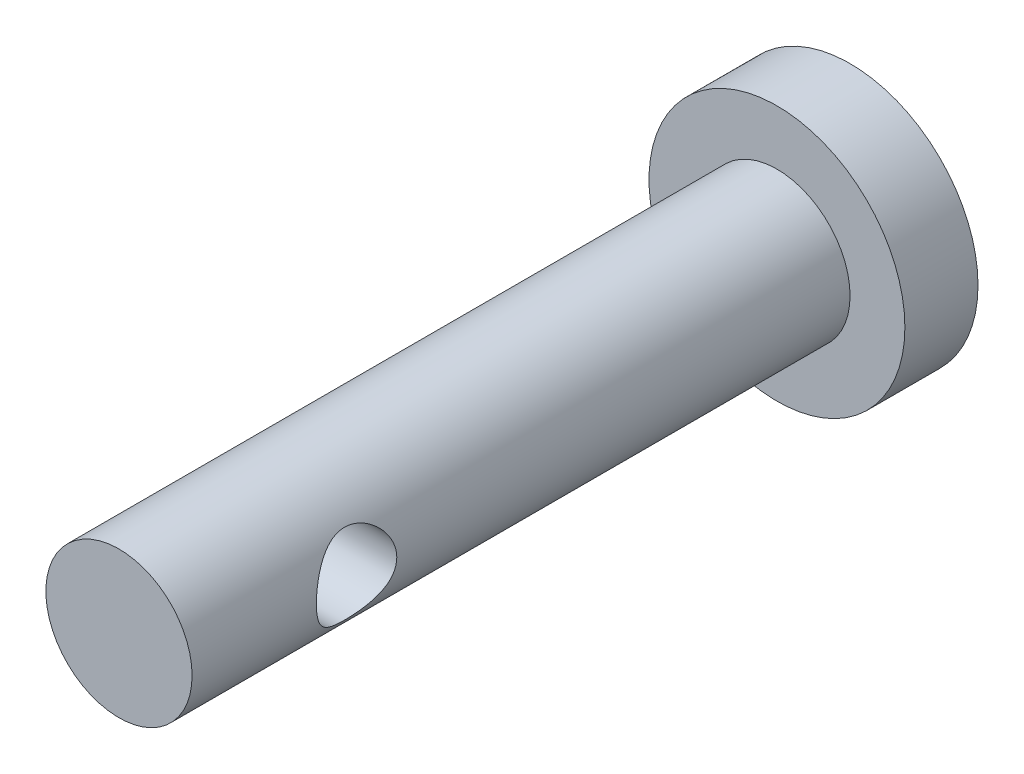
ISO-10303-21;
HEADER;
FILE_DESCRIPTION(('STEP AP214'),'2;1');
FILE_NAME('part.step','',(''),(''),'','','');
FILE_SCHEMA(('AUTOMOTIVE_DESIGN { 1 0 10303 214 1 1 1 1 }'));
ENDSEC;
DATA;
#1=APPLICATION_CONTEXT('core data for automotive mechanical design processes');
#2=APPLICATION_PROTOCOL_DEFINITION('international standard','automotive_design',2000,#1);
#3=PRODUCT_CONTEXT('',#1,'mechanical');
#4=PRODUCT('Part','Part','',(#3));
#5=PRODUCT_RELATED_PRODUCT_CATEGORY('part','',(#4));
#6=PRODUCT_DEFINITION_FORMATION('','',#4);
#7=PRODUCT_DEFINITION_CONTEXT('part definition',#1,'design');
#8=PRODUCT_DEFINITION('design','',#6,#7);
#9=PRODUCT_DEFINITION_SHAPE('','',#8);
#10=(LENGTH_UNIT() NAMED_UNIT(*) SI_UNIT(.MILLI.,.METRE.));
#11=(NAMED_UNIT(*) PLANE_ANGLE_UNIT() SI_UNIT($,.RADIAN.));
#12=(NAMED_UNIT(*) SI_UNIT($,.STERADIAN.) SOLID_ANGLE_UNIT());
#13=UNCERTAINTY_MEASURE_WITH_UNIT(LENGTH_MEASURE(1.E-05),#10,'distance_accuracy_value','');
#14=(GEOMETRIC_REPRESENTATION_CONTEXT(3) GLOBAL_UNCERTAINTY_ASSIGNED_CONTEXT((#13)) GLOBAL_UNIT_ASSIGNED_CONTEXT((#10,
#11,#12)) REPRESENTATION_CONTEXT('',''));
#15=CARTESIAN_POINT('',(0.,0.,0.));
#16=DIRECTION('',(0.,0.,1.));
#17=DIRECTION('',(1.,0.,0.));
#18=AXIS2_PLACEMENT_3D('',#15,#16,#17);
#19=CARTESIAN_POINT('',(0.,0.,2.));
#20=DIRECTION('',(0.,0.,-1.));
#21=DIRECTION('',(-1.,0.,0.));
#22=AXIS2_PLACEMENT_3D('',#19,#20,#21);
#23=CYLINDRICAL_SURFACE('',#22,3.5);
#24=CARTESIAN_POINT('',(0.,0.,2.));
#25=DIRECTION('',(0.,0.,1.));
#26=DIRECTION('',(1.,0.,0.));
#27=AXIS2_PLACEMENT_3D('',#24,#25,#26);
#28=CIRCLE('',#27,3.5);
#29=CARTESIAN_POINT('',(3.5,0.,2.));
#30=VERTEX_POINT('',#29);
#31=EDGE_CURVE('E52',#30,#30,#28,.T.);
#32=ORIENTED_EDGE('',*,*,#31,.F.);
#33=EDGE_LOOP('',(#32));
#34=FACE_BOUND('',#33,.T.);
#35=CARTESIAN_POINT('',(0.,0.,0.));
#36=DIRECTION('',(0.,0.,1.));
#37=DIRECTION('',(1.,0.,0.));
#38=AXIS2_PLACEMENT_3D('',#35,#36,#37);
#39=CIRCLE('',#38,3.5);
#40=CARTESIAN_POINT('',(3.5,0.,0.));
#41=VERTEX_POINT('',#40);
#42=EDGE_CURVE('E58',#41,#41,#39,.T.);
#43=ORIENTED_EDGE('',*,*,#42,.T.);
#44=EDGE_LOOP('',(#43));
#45=FACE_BOUND('',#44,.T.);
#46=ADVANCED_FACE('F36',(#34,#45),#23,.T.);
#47=CARTESIAN_POINT('',(0.,0.,2.));
#48=DIRECTION('',(0.,0.,1.));
#49=DIRECTION('',(1.,0.,0.));
#50=AXIS2_PLACEMENT_3D('',#47,#48,#49);
#51=PLANE('',#50);
#52=CARTESIAN_POINT('',(0.,0.,2.));
#53=DIRECTION('',(0.,0.,1.));
#54=DIRECTION('',(1.,0.,0.));
#55=AXIS2_PLACEMENT_3D('',#52,#53,#54);
#56=CIRCLE('',#55,2.);
#57=CARTESIAN_POINT('',(2.,0.,2.));
#58=VERTEX_POINT('',#57);
#59=EDGE_CURVE('E48',#58,#58,#56,.T.);
#60=ORIENTED_EDGE('',*,*,#59,.F.);
#61=EDGE_LOOP('',(#60));
#62=FACE_BOUND('',#61,.T.);
#63=ORIENTED_EDGE('',*,*,#31,.T.);
#64=EDGE_LOOP('',(#63));
#65=FACE_BOUND('',#64,.T.);
#66=ADVANCED_FACE('F80',(#62,#65),#51,.T.);
#67=CARTESIAN_POINT('',(0.,0.,0.));
#68=DIRECTION('',(0.,0.,1.));
#69=DIRECTION('',(1.,0.,0.));
#70=AXIS2_PLACEMENT_3D('',#67,#68,#69);
#71=PLANE('',#70);
#72=ORIENTED_EDGE('',*,*,#42,.F.);
#73=EDGE_LOOP('',(#72));
#74=FACE_BOUND('',#73,.T.);
#75=ADVANCED_FACE('F76',(#74),#71,.F.);
#76=CARTESIAN_POINT('',(0.,0.,20.));
#77=DIRECTION('',(0.,0.,-1.));
#78=DIRECTION('',(-1.,0.,0.));
#79=AXIS2_PLACEMENT_3D('',#76,#77,#78);
#80=CYLINDRICAL_SURFACE('',#79,2.);
#81=CARTESIAN_POINT('',(2.,0.,16.6));
#82=CARTESIAN_POINT('',(1.99999675924308,0.0571132983637053,16.5999964110813));
#83=CARTESIAN_POINT('',(1.99752868170342,0.114272714137144,16.5955262362727));
#84=CARTESIAN_POINT('',(1.98789855994148,0.226857367817319,16.5778651898464));
#85=CARTESIAN_POINT('',(1.98073010854729,0.282280130253228,16.5646624144346));
#86=CARTESIAN_POINT('',(1.96243812463521,0.389601051952438,16.5302303571189));
#87=CARTESIAN_POINT('',(1.95133089970991,0.44151270844495,16.5090341475802));
#88=CARTESIAN_POINT('',(1.92614108353208,0.540938827090506,16.4594142212174));
#89=CARTESIAN_POINT('',(1.91205836516769,0.588453101264448,16.4309901956133));
#90=CARTESIAN_POINT('',(1.88102168662336,0.681410795715168,16.3655231112503));
#91=CARTESIAN_POINT('',(1.86393685342201,0.726486915618605,16.3280216503706));
#92=CARTESIAN_POINT('',(1.82916903148557,0.810057561556778,16.2464722610266));
#93=CARTESIAN_POINT('',(1.81148550185214,0.848545934897066,16.2024182837536));
#94=CARTESIAN_POINT('',(1.77547930553327,0.921679451273309,16.1038493427182));
#95=CARTESIAN_POINT('',(1.757265310528,0.955572384755911,16.0487313590102));
#96=CARTESIAN_POINT('',(1.72452224317789,1.01347698490626,15.9325150895782));
#97=CARTESIAN_POINT('',(1.70999026263348,1.0374964594112,15.8714215767618));
#98=CARTESIAN_POINT('',(1.68775650057705,1.07326593950759,15.7488203677151));
#99=CARTESIAN_POINT('',(1.67968128236562,1.08569508898053,15.6875825643648));
#100=CARTESIAN_POINT('',(1.67039270422593,1.09994080420756,15.5634070342956));
#101=CARTESIAN_POINT('',(1.66916950596314,1.10177258610198,15.5004718753173));
#102=CARTESIAN_POINT('',(1.67343764484105,1.09526666719243,15.385047762167));
#103=CARTESIAN_POINT('',(1.67793532909928,1.08843438295616,15.3324268276671));
#104=CARTESIAN_POINT('',(1.69135685033582,1.06745759351263,15.2292470533978));
#105=CARTESIAN_POINT('',(1.70028270327645,1.05330975771273,15.1786891642039));
#106=CARTESIAN_POINT('',(1.72170753964095,1.0179176089501,15.0796784533327));
#107=CARTESIAN_POINT('',(1.73427940344615,0.996526887131073,15.0312945081385));
#108=CARTESIAN_POINT('',(1.76160601646088,0.947382866660586,14.9385526529354));
#109=CARTESIAN_POINT('',(1.77636170690481,0.91962682169107,14.8941964922787));
#110=CARTESIAN_POINT('',(1.8091936056527,0.853455662743701,14.8034034776133));
#111=CARTESIAN_POINT('',(1.82742638095051,0.814049722616954,14.7577426320771));
#112=CARTESIAN_POINT('',(1.86331585258471,0.728163547976673,14.6733156128991));
#113=CARTESIAN_POINT('',(1.88097214812395,0.681678513773091,14.6345541560717));
#114=CARTESIAN_POINT('',(1.91514756035155,0.579070027867289,14.5625234488777));
#115=CARTESIAN_POINT('',(1.93151098770795,0.522509240968693,14.5297969062474));
#116=CARTESIAN_POINT('',(1.95981018910102,0.403568251763486,14.4746128310417));
#117=CARTESIAN_POINT('',(1.97175012386492,0.341193587463994,14.4521456438889));
#118=CARTESIAN_POINT('',(1.98888897082801,0.218604691987317,14.4202585263745));
#119=CARTESIAN_POINT('',(1.99461215188408,0.158730320348858,14.4098182989883));
#120=CARTESIAN_POINT('',(2.00055584441335,0.0378216889616743,14.3989794475287));
#121=CARTESIAN_POINT('',(2.00077987218944,-0.0232118046229579,14.3985744066921));
#122=CARTESIAN_POINT('',(1.99596118554524,-0.13832491676724,14.4073563422037));
#123=CARTESIAN_POINT('',(1.99143106391449,-0.192501184158295,14.4156097341879));
#124=CARTESIAN_POINT('',(1.9783119588675,-0.298559233083234,14.4398950648884));
#125=CARTESIAN_POINT('',(1.96972256491388,-0.350440781958609,14.4559277903776));
#126=CARTESIAN_POINT('',(1.94899585358496,-0.451835605243937,14.4955717439678));
#127=CARTESIAN_POINT('',(1.93678316763217,-0.501269493963586,14.5193451303646));
#128=CARTESIAN_POINT('',(1.90989476735531,-0.595575466499804,14.5735808975332));
#129=CARTESIAN_POINT('',(1.89521815331033,-0.640445874282739,14.6040457229891));
#130=CARTESIAN_POINT('',(1.86280221062633,-0.729703041926062,14.6746964760922));
#131=CARTESIAN_POINT('',(1.84490394898361,-0.773473362505451,14.7155888557727));
#132=CARTESIAN_POINT('',(1.80910293824503,-0.85386608675192,14.803949619785));
#133=CARTESIAN_POINT('',(1.79120020370973,-0.890481038324776,14.8514247728549));
#134=CARTESIAN_POINT('',(1.7559058367425,-0.958315027111075,14.9561094622714));
#135=CARTESIAN_POINT('',(1.73866197158591,-0.98889384552866,15.0137887179169));
#136=CARTESIAN_POINT('',(1.70882042661936,-1.03961917769188,15.1346627198058));
#137=CARTESIAN_POINT('',(1.69621598702366,-1.05978088692977,15.1978492742666));
#138=CARTESIAN_POINT('',(1.67883613638257,-1.08708308369362,15.3215082517237));
#139=CARTESIAN_POINT('',(1.67342014768831,-1.09529651711391,15.381649853693));
#140=CARTESIAN_POINT('',(1.66924062339871,-1.10166023274854,15.5026736461921));
#141=CARTESIAN_POINT('',(1.67047137736522,-1.09981915311486,15.5635551561819));
#142=CARTESIAN_POINT('',(1.67871913798272,-1.08717127824635,15.6754796810369));
#143=CARTESIAN_POINT('',(1.68492582745766,-1.07761883611353,15.7267339823549));
#144=CARTESIAN_POINT('',(1.70128097168541,-1.05160719986521,15.8267969459739));
#145=CARTESIAN_POINT('',(1.71143104554587,-1.0351451685295,15.875604594402));
#146=CARTESIAN_POINT('',(1.73526499534195,-0.994704078643835,15.9727597641932));
#147=CARTESIAN_POINT('',(1.74912723822165,-0.970326360027855,16.0208959972579));
#148=CARTESIAN_POINT('',(1.77863114530158,-0.915123397303249,16.1127173476752));
#149=CARTESIAN_POINT('',(1.79427375178188,-0.884294731643489,16.1564000845553));
#150=CARTESIAN_POINT('',(1.82850690710462,-0.811433379245057,16.2452331596692));
#151=CARTESIAN_POINT('',(1.84717497232162,-0.768401762627388,16.289538823315));
#152=CARTESIAN_POINT('',(1.8832440998029,-0.675195673587142,16.3705896181383));
#153=CARTESIAN_POINT('',(1.90064424663484,-0.625016116121916,16.4073293209931));
#154=CARTESIAN_POINT('',(1.93298792825492,-0.516591509830361,16.473292022683));
#155=CARTESIAN_POINT('',(1.94782493561387,-0.458126594931795,16.5022090429478));
#156=CARTESIAN_POINT('',(1.97252278605601,-0.336149093621828,16.5494064762103));
#157=CARTESIAN_POINT('',(1.98239638103224,-0.272649932634817,16.5677141651786));
#158=CARTESIAN_POINT('',(1.99274289837176,-0.173673745678196,16.5867613720092));
#159=CARTESIAN_POINT('',(1.99545338889598,-0.139188704288957,16.5917149546751));
#160=CARTESIAN_POINT('',(1.99908291729893,-0.0698081822667161,16.5983353418803));
#161=CARTESIAN_POINT('',(2.00000198103772,-0.034912707565821,16.6000021938651));
#162=CARTESIAN_POINT('',(2.,0.,16.6));
#163=B_SPLINE_CURVE_WITH_KNOTS('',3,(#81,#82,#83,#84,#85,#86,#87,#88,#89,#90,#91,#92,#93,#94,
#95,#96,#97,#98,#99,#100,#101,#102,#103,#104,#105,#106,#107,#108,#109,#110,#111,#112,#113,#114,
#115,#116,#117,#118,#119,#120,#121,#122,#123,#124,#125,#126,#127,#128,#129,#130,#131,#132,#133,
#134,#135,#136,#137,#138,#139,#140,#141,#142,#143,#144,#145,#146,#147,#148,#149,#150,#151,#152,
#153,#154,#155,#156,#157,#158,#159,#160,#161,#162),.UNSPECIFIED.,.T.,.F.,(4,2,2,2,2,2,2,2,2,2,2,
2,2,2,2,2,2,2,2,2,2,2,2,2,2,2,2,2,2,2,2,2,2,2,2,2,2,2,2,2,4),(0.,0.171199344358618,
0.342632540401882,0.51336408792254,0.684102930499837,0.866587011965209,1.04924060721242,
1.24988921906168,1.45037885323007,1.63820507654229,1.82576154410213,1.98477085900252,
2.1438526307987,2.30636384257481,2.46894530214969,2.65717988177281,2.84554265907865,
3.04653860187247,3.24734500543234,3.42944876020858,3.61143607003036,3.77563727928096,
3.93985509869252,4.10776203717806,4.27573042197356,4.46250195720548,4.64946698449144,
4.85095752755102,5.05215331954838,5.23384219794165,5.41537500620962,5.57220088279752,
5.72909121842911,5.89559110105391,6.06217951927695,6.25489989789972,6.44775806886046,
6.64732586662592,6.84637828457194,6.95103200094554,7.05568420658406),.UNSPECIFIED.);
#164=CARTESIAN_POINT('',(2.,0.,16.6));
#165=VERTEX_POINT('',#164);
#166=EDGE_CURVE('E39',#165,#165,#163,.T.);
#167=ORIENTED_EDGE('',*,*,#166,.T.);
#168=EDGE_LOOP('',(#167));
#169=FACE_BOUND('',#168,.T.);
#170=CARTESIAN_POINT('',(-2.,0.,16.6));
#171=CARTESIAN_POINT('',(-1.99999675924308,-0.0571132983637053,16.5999964110813));
#172=CARTESIAN_POINT('',(-1.99752868170342,-0.114272714137144,16.5955262362727));
#173=CARTESIAN_POINT('',(-1.98789855994148,-0.226857367817319,16.5778651898464));
#174=CARTESIAN_POINT('',(-1.98073010854729,-0.282280130253228,16.5646624144346));
#175=CARTESIAN_POINT('',(-1.96243812463521,-0.389601051952438,16.5302303571189));
#176=CARTESIAN_POINT('',(-1.95133089970991,-0.44151270844495,16.5090341475802));
#177=CARTESIAN_POINT('',(-1.92614108353208,-0.540938827090506,16.4594142212174));
#178=CARTESIAN_POINT('',(-1.91205836516769,-0.588453101264448,16.4309901956133));
#179=CARTESIAN_POINT('',(-1.88102168662336,-0.681410795715168,16.3655231112503));
#180=CARTESIAN_POINT('',(-1.86393685342201,-0.726486915618605,16.3280216503706));
#181=CARTESIAN_POINT('',(-1.82916903148557,-0.810057561556778,16.2464722610266));
#182=CARTESIAN_POINT('',(-1.81148550185214,-0.848545934897066,16.2024182837536));
#183=CARTESIAN_POINT('',(-1.77547930553327,-0.921679451273309,16.1038493427182));
#184=CARTESIAN_POINT('',(-1.757265310528,-0.955572384755911,16.0487313590102));
#185=CARTESIAN_POINT('',(-1.72452224317789,-1.01347698490626,15.9325150895782));
#186=CARTESIAN_POINT('',(-1.70999026263348,-1.0374964594112,15.8714215767618));
#187=CARTESIAN_POINT('',(-1.68775650057705,-1.07326593950759,15.7488203677151));
#188=CARTESIAN_POINT('',(-1.67968128236562,-1.08569508898053,15.6875825643648));
#189=CARTESIAN_POINT('',(-1.67039270422593,-1.09994080420756,15.5634070342956));
#190=CARTESIAN_POINT('',(-1.66916950596314,-1.10177258610198,15.5004718753173));
#191=CARTESIAN_POINT('',(-1.67343764484105,-1.09526666719243,15.385047762167));
#192=CARTESIAN_POINT('',(-1.67793532909928,-1.08843438295616,15.3324268276671));
#193=CARTESIAN_POINT('',(-1.69135685033582,-1.06745759351263,15.2292470533978));
#194=CARTESIAN_POINT('',(-1.70028270327645,-1.05330975771273,15.1786891642039));
#195=CARTESIAN_POINT('',(-1.72170753964095,-1.0179176089501,15.0796784533327));
#196=CARTESIAN_POINT('',(-1.73427940344615,-0.996526887131073,15.0312945081385));
#197=CARTESIAN_POINT('',(-1.76160601646088,-0.947382866660586,14.9385526529354));
#198=CARTESIAN_POINT('',(-1.77636170690481,-0.91962682169107,14.8941964922787));
#199=CARTESIAN_POINT('',(-1.8091936056527,-0.853455662743701,14.8034034776133));
#200=CARTESIAN_POINT('',(-1.82742638095051,-0.814049722616954,14.7577426320771));
#201=CARTESIAN_POINT('',(-1.86331585258471,-0.728163547976673,14.6733156128991));
#202=CARTESIAN_POINT('',(-1.88097214812395,-0.681678513773091,14.6345541560717));
#203=CARTESIAN_POINT('',(-1.91514756035155,-0.579070027867289,14.5625234488777));
#204=CARTESIAN_POINT('',(-1.93151098770795,-0.522509240968693,14.5297969062474));
#205=CARTESIAN_POINT('',(-1.95981018910102,-0.403568251763486,14.4746128310417));
#206=CARTESIAN_POINT('',(-1.97175012386492,-0.341193587463994,14.4521456438889));
#207=CARTESIAN_POINT('',(-1.98888897082801,-0.218604691987317,14.4202585263745));
#208=CARTESIAN_POINT('',(-1.99461215188408,-0.158730320348858,14.4098182989883));
#209=CARTESIAN_POINT('',(-2.00055584441335,-0.0378216889616743,14.3989794475287));
#210=CARTESIAN_POINT('',(-2.00077987218944,0.0232118046229579,14.3985744066921));
#211=CARTESIAN_POINT('',(-1.99596118554524,0.13832491676724,14.4073563422037));
#212=CARTESIAN_POINT('',(-1.99143106391449,0.192501184158295,14.4156097341879));
#213=CARTESIAN_POINT('',(-1.9783119588675,0.298559233083234,14.4398950648884));
#214=CARTESIAN_POINT('',(-1.96972256491388,0.350440781958609,14.4559277903776));
#215=CARTESIAN_POINT('',(-1.94899585358496,0.451835605243937,14.4955717439678));
#216=CARTESIAN_POINT('',(-1.93678316763217,0.501269493963586,14.5193451303646));
#217=CARTESIAN_POINT('',(-1.90989476735531,0.595575466499804,14.5735808975332));
#218=CARTESIAN_POINT('',(-1.89521815331033,0.640445874282739,14.6040457229891));
#219=CARTESIAN_POINT('',(-1.86280221062633,0.729703041926062,14.6746964760922));
#220=CARTESIAN_POINT('',(-1.84490394898361,0.773473362505451,14.7155888557727));
#221=CARTESIAN_POINT('',(-1.80910293824503,0.85386608675192,14.803949619785));
#222=CARTESIAN_POINT('',(-1.79120020370973,0.890481038324776,14.8514247728549));
#223=CARTESIAN_POINT('',(-1.7559058367425,0.958315027111075,14.9561094622714));
#224=CARTESIAN_POINT('',(-1.73866197158591,0.98889384552866,15.0137887179169));
#225=CARTESIAN_POINT('',(-1.70882042661936,1.03961917769188,15.1346627198058));
#226=CARTESIAN_POINT('',(-1.69621598702366,1.05978088692977,15.1978492742666));
#227=CARTESIAN_POINT('',(-1.67883613638257,1.08708308369362,15.3215082517237));
#228=CARTESIAN_POINT('',(-1.67342014768831,1.09529651711391,15.381649853693));
#229=CARTESIAN_POINT('',(-1.66924062339871,1.10166023274854,15.5026736461921));
#230=CARTESIAN_POINT('',(-1.67047137736522,1.09981915311486,15.5635551561819));
#231=CARTESIAN_POINT('',(-1.67871913798272,1.08717127824635,15.6754796810369));
#232=CARTESIAN_POINT('',(-1.68492582745766,1.07761883611353,15.7267339823549));
#233=CARTESIAN_POINT('',(-1.70128097168541,1.05160719986521,15.8267969459739));
#234=CARTESIAN_POINT('',(-1.71143104554587,1.0351451685295,15.875604594402));
#235=CARTESIAN_POINT('',(-1.73526499534195,0.994704078643835,15.9727597641932));
#236=CARTESIAN_POINT('',(-1.74912723822165,0.970326360027855,16.0208959972579));
#237=CARTESIAN_POINT('',(-1.77863114530158,0.915123397303249,16.1127173476752));
#238=CARTESIAN_POINT('',(-1.79427375178188,0.884294731643489,16.1564000845553));
#239=CARTESIAN_POINT('',(-1.82850690710462,0.811433379245057,16.2452331596692));
#240=CARTESIAN_POINT('',(-1.84717497232162,0.768401762627388,16.289538823315));
#241=CARTESIAN_POINT('',(-1.8832440998029,0.675195673587142,16.3705896181383));
#242=CARTESIAN_POINT('',(-1.90064424663484,0.625016116121916,16.4073293209931));
#243=CARTESIAN_POINT('',(-1.93298792825492,0.516591509830361,16.473292022683));
#244=CARTESIAN_POINT('',(-1.94782493561387,0.458126594931795,16.5022090429478));
#245=CARTESIAN_POINT('',(-1.97252278605601,0.336149093621828,16.5494064762103));
#246=CARTESIAN_POINT('',(-1.98239638103224,0.272649932634817,16.5677141651786));
#247=CARTESIAN_POINT('',(-1.99274289837176,0.173673745678196,16.5867613720092));
#248=CARTESIAN_POINT('',(-1.99545338889598,0.139188704288957,16.5917149546751));
#249=CARTESIAN_POINT('',(-1.99908291729893,0.0698081822667161,16.5983353418803));
#250=CARTESIAN_POINT('',(-2.00000198103772,0.034912707565821,16.6000021938651));
#251=CARTESIAN_POINT('',(-2.,0.,16.6));
#252=B_SPLINE_CURVE_WITH_KNOTS('',3,(#170,#171,#172,#173,#174,#175,#176,#177,#178,#179,#180,
#181,#182,#183,#184,#185,#186,#187,#188,#189,#190,#191,#192,#193,#194,#195,#196,#197,#198,#199,
#200,#201,#202,#203,#204,#205,#206,#207,#208,#209,#210,#211,#212,#213,#214,#215,#216,#217,#218,
#219,#220,#221,#222,#223,#224,#225,#226,#227,#228,#229,#230,#231,#232,#233,#234,#235,#236,#237,
#238,#239,#240,#241,#242,#243,#244,#245,#246,#247,#248,#249,#250,#251),.UNSPECIFIED.,.T.,.F.,(4,
2,2,2,2,2,2,2,2,2,2,2,2,2,2,2,2,2,2,2,2,2,2,2,2,2,2,2,2,2,2,2,2,2,2,2,2,2,2,2,4),(0.,
0.171199344358618,0.342632540401882,0.51336408792254,0.684102930499837,0.866587011965209,
1.04924060721242,1.24988921906168,1.45037885323007,1.63820507654229,1.82576154410213,
1.98477085900252,2.1438526307987,2.30636384257481,2.46894530214969,2.65717988177281,
2.84554265907865,3.04653860187247,3.24734500543234,3.42944876020858,3.61143607003036,
3.77563727928096,3.93985509869252,4.10776203717806,4.27573042197356,4.46250195720548,
4.64946698449144,4.85095752755102,5.05215331954838,5.23384219794165,5.41537500620962,
5.57220088279752,5.72909121842911,5.89559110105391,6.06217951927695,6.25489989789972,
6.44775806886046,6.64732586662592,6.84637828457194,6.95103200094554,7.05568420658406),.UNSPECIFIED.);
#253=CARTESIAN_POINT('',(-2.,0.,16.6));
#254=VERTEX_POINT('',#253);
#255=EDGE_CURVE('E10',#254,#254,#252,.T.);
#256=ORIENTED_EDGE('',*,*,#255,.T.);
#257=EDGE_LOOP('',(#256));
#258=FACE_BOUND('',#257,.T.);
#259=CARTESIAN_POINT('',(0.,0.,20.));
#260=DIRECTION('',(0.,0.,1.));
#261=DIRECTION('',(1.,0.,0.));
#262=AXIS2_PLACEMENT_3D('',#259,#260,#261);
#263=CIRCLE('',#262,2.);
#264=CARTESIAN_POINT('',(2.,0.,20.));
#265=VERTEX_POINT('',#264);
#266=EDGE_CURVE('E92',#265,#265,#263,.T.);
#267=ORIENTED_EDGE('',*,*,#266,.F.);
#268=EDGE_LOOP('',(#267));
#269=FACE_BOUND('',#268,.T.);
#270=ORIENTED_EDGE('',*,*,#59,.T.);
#271=EDGE_LOOP('',(#270));
#272=FACE_BOUND('',#271,.T.);
#273=ADVANCED_FACE('F60',(#169,#258,#269,#272),#80,.T.);
#274=CARTESIAN_POINT('',(0.,0.,20.));
#275=DIRECTION('',(0.,0.,1.));
#276=DIRECTION('',(1.,0.,0.));
#277=AXIS2_PLACEMENT_3D('',#274,#275,#276);
#278=PLANE('',#277);
#279=ORIENTED_EDGE('',*,*,#266,.T.);
#280=EDGE_LOOP('',(#279));
#281=FACE_BOUND('',#280,.T.);
#282=ADVANCED_FACE('F67',(#281),#278,.T.);
#283=CARTESIAN_POINT('',(3.5,0.,15.5));
#284=DIRECTION('',(-1.,0.,0.));
#285=DIRECTION('',(0.,0.,1.));
#286=AXIS2_PLACEMENT_3D('',#283,#284,#285);
#287=CYLINDRICAL_SURFACE('',#286,1.1);
#288=ORIENTED_EDGE('',*,*,#166,.F.);
#289=EDGE_LOOP('',(#288));
#290=FACE_BOUND('',#289,.T.);
#291=ORIENTED_EDGE('',*,*,#255,.F.);
#292=EDGE_LOOP('',(#291));
#293=FACE_BOUND('',#292,.T.);
#294=ADVANCED_FACE('F64',(#290,#293),#287,.F.);
#295=CLOSED_SHELL('',(#46,#66,#75,#273,#282,#294));
#296=MANIFOLD_SOLID_BREP('B2',#295);
#297=ADVANCED_BREP_SHAPE_REPRESENTATION('',(#18,#296),#14);
#298=SHAPE_DEFINITION_REPRESENTATION(#9,#297);
ENDSEC;
END-ISO-10303-21;
